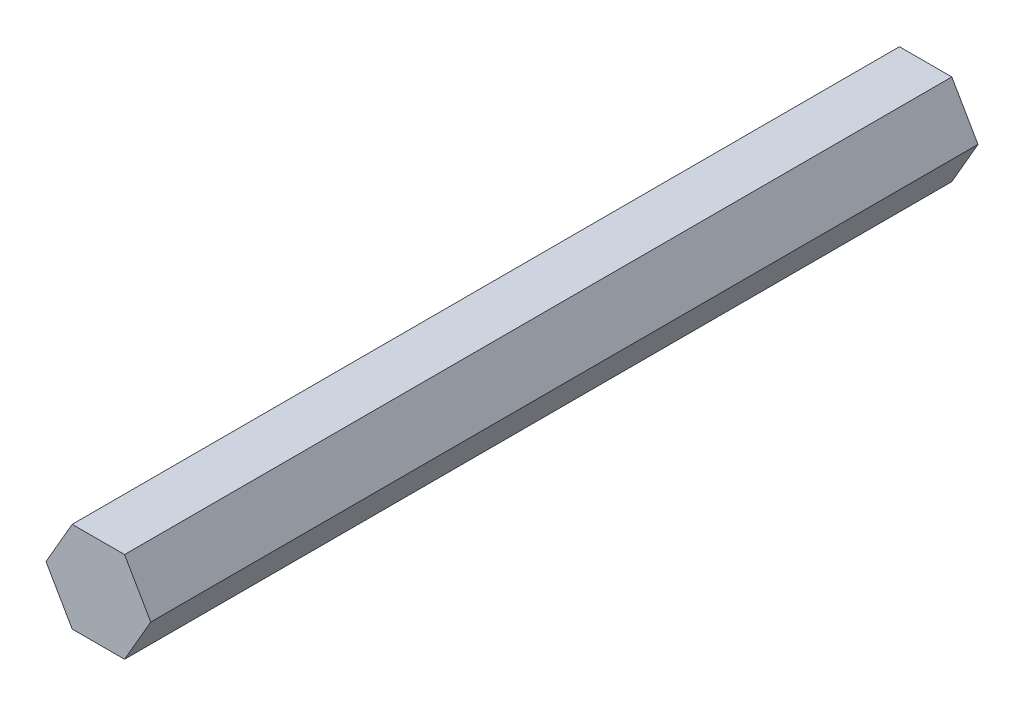
ISO-10303-21;
HEADER;
FILE_DESCRIPTION(('STEP AP214'),'2;1');
FILE_NAME('part.step','',(''),(''),'','','');
FILE_SCHEMA(('AUTOMOTIVE_DESIGN { 1 0 10303 214 1 1 1 1 }'));
ENDSEC;
DATA;
#1=APPLICATION_CONTEXT('core data for automotive mechanical design processes');
#2=APPLICATION_PROTOCOL_DEFINITION('international standard','automotive_design',2000,#1);
#3=PRODUCT_CONTEXT('',#1,'mechanical');
#4=PRODUCT('Part','Part','',(#3));
#5=PRODUCT_RELATED_PRODUCT_CATEGORY('part','',(#4));
#6=PRODUCT_DEFINITION_FORMATION('','',#4);
#7=PRODUCT_DEFINITION_CONTEXT('part definition',#1,'design');
#8=PRODUCT_DEFINITION('design','',#6,#7);
#9=PRODUCT_DEFINITION_SHAPE('','',#8);
#10=(LENGTH_UNIT() NAMED_UNIT(*) SI_UNIT(.MILLI.,.METRE.));
#11=(NAMED_UNIT(*) PLANE_ANGLE_UNIT() SI_UNIT($,.RADIAN.));
#12=(NAMED_UNIT(*) SI_UNIT($,.STERADIAN.) SOLID_ANGLE_UNIT());
#13=UNCERTAINTY_MEASURE_WITH_UNIT(LENGTH_MEASURE(1.E-05),#10,'distance_accuracy_value','');
#14=(GEOMETRIC_REPRESENTATION_CONTEXT(3) GLOBAL_UNCERTAINTY_ASSIGNED_CONTEXT((#13)) GLOBAL_UNIT_ASSIGNED_CONTEXT((#10,
#11,#12)) REPRESENTATION_CONTEXT('',''));
#15=CARTESIAN_POINT('',(0.,0.,0.));
#16=DIRECTION('',(0.,0.,1.));
#17=DIRECTION('',(1.,0.,0.));
#18=AXIS2_PLACEMENT_3D('',#15,#16,#17);
#19=CARTESIAN_POINT('',(-61.7065298609531,-5.99818575147754,115.216279792222));
#20=DIRECTION('',(0.866025403784439,-0.5,0.));
#21=DIRECTION('',(0.,0.,1.));
#22=AXIS2_PLACEMENT_3D('',#19,#20,#21);
#23=PLANE('',#22);
#24=DIRECTION('',(0.5,0.866025403784439,0.));
#25=VECTOR('',#24,1.);
#26=CARTESIAN_POINT('',(-61.7065298609531,-5.99818575147755,-0.607720207778412));
#27=LINE('',#26,#25);
#28=CARTESIAN_POINT('',(-65.3727040703072,-12.3481857514776,-0.607720207778412));
#29=VERTEX_POINT('',#28);
#30=CARTESIAN_POINT('',(-61.7065298609531,-5.99818575147757,-0.607720207778412));
#31=VERTEX_POINT('',#30);
#32=EDGE_CURVE('E87',#29,#31,#27,.T.);
#33=ORIENTED_EDGE('',*,*,#32,.F.);
#34=DIRECTION('',(0.,0.,1.));
#35=VECTOR('',#34,1.);
#36=CARTESIAN_POINT('',(-65.3727040703072,-12.3481857514775,115.216279792222));
#37=LINE('',#36,#35);
#38=CARTESIAN_POINT('',(-65.3727040703072,-12.3481857514775,115.216279792222));
#39=VERTEX_POINT('',#38);
#40=EDGE_CURVE('E41',#39,#29,#37,.F.);
#41=ORIENTED_EDGE('',*,*,#40,.F.);
#42=DIRECTION('',(-0.5,-0.866025403784439,0.));
#43=VECTOR('',#42,1.);
#44=CARTESIAN_POINT('',(-67.2057911749843,-15.5231857514775,115.216279792222));
#45=LINE('',#44,#43);
#46=CARTESIAN_POINT('',(-61.7065298609531,-5.99818575147754,115.216279792222));
#47=VERTEX_POINT('',#46);
#48=EDGE_CURVE('E138',#47,#39,#45,.T.);
#49=ORIENTED_EDGE('',*,*,#48,.F.);
#50=DIRECTION('',(0.,0.,1.));
#51=VECTOR('',#50,1.);
#52=CARTESIAN_POINT('',(-61.7065298609531,-5.99818575147754,115.216279792222));
#53=LINE('',#52,#51);
#54=EDGE_CURVE('E141',#47,#31,#53,.F.);
#55=ORIENTED_EDGE('',*,*,#54,.T.);
#56=EDGE_LOOP('',(#33,#41,#49,#55));
#57=FACE_BOUND('',#56,.T.);
#58=ADVANCED_FACE('F37',(#57),#23,.F.);
#59=CARTESIAN_POINT('',(-61.7065298609531,-18.6981857514775,115.216279792222));
#60=DIRECTION('',(0.,1.,0.));
#61=DIRECTION('',(-1.,0.,0.));
#62=AXIS2_PLACEMENT_3D('',#59,#60,#61);
#63=PLANE('',#62);
#64=DIRECTION('',(-1.,0.,0.));
#65=VECTOR('',#64,1.);
#66=CARTESIAN_POINT('',(-61.7065298609531,-18.6981857514776,-0.607720207778412));
#67=LINE('',#66,#65);
#68=CARTESIAN_POINT('',(-54.3741814422448,-18.6981857514776,-0.607720207778412));
#69=VERTEX_POINT('',#68);
#70=CARTESIAN_POINT('',(-61.706529860953,-18.6981857514776,-0.607720207778407));
#71=VERTEX_POINT('',#70);
#72=EDGE_CURVE('E157',#69,#71,#67,.T.);
#73=ORIENTED_EDGE('',*,*,#72,.F.);
#74=DIRECTION('',(0.,0.,-1.));
#75=VECTOR('',#74,1.);
#76=CARTESIAN_POINT('',(-54.3741814422448,-18.6981857514775,115.216279792222));
#77=LINE('',#76,#75);
#78=CARTESIAN_POINT('',(-54.3741814422448,-18.6981857514775,115.216279792222));
#79=VERTEX_POINT('',#78);
#80=EDGE_CURVE('E154',#69,#79,#77,.F.);
#81=ORIENTED_EDGE('',*,*,#80,.T.);
#82=DIRECTION('',(1.,0.,0.));
#83=VECTOR('',#82,1.);
#84=CARTESIAN_POINT('',(-61.7065298609531,-18.6981857514775,115.216279792222));
#85=LINE('',#84,#83);
#86=CARTESIAN_POINT('',(-61.7065298609531,-18.6981857514775,115.216279792222));
#87=VERTEX_POINT('',#86);
#88=EDGE_CURVE('E149',#87,#79,#85,.T.);
#89=ORIENTED_EDGE('',*,*,#88,.F.);
#90=DIRECTION('',(0.,0.,1.));
#91=VECTOR('',#90,1.);
#92=CARTESIAN_POINT('',(-61.7065298609531,-18.6981857514775,115.216279792222));
#93=LINE('',#92,#91);
#94=EDGE_CURVE('E155',#71,#87,#93,.T.);
#95=ORIENTED_EDGE('',*,*,#94,.F.);
#96=EDGE_LOOP('',(#73,#81,#89,#95));
#97=FACE_BOUND('',#96,.T.);
#98=ADVANCED_FACE('F121',(#97),#63,.F.);
#99=CARTESIAN_POINT('',(-54.3741814422448,-18.6981857514775,115.216279792222));
#100=DIRECTION('',(-0.866025403784439,0.5,0.));
#101=DIRECTION('',(0.,0.,-1.));
#102=AXIS2_PLACEMENT_3D('',#99,#100,#101);
#103=PLANE('',#102);
#104=DIRECTION('',(-0.5,-0.866025403784439,0.));
#105=VECTOR('',#104,1.);
#106=CARTESIAN_POINT('',(-54.3741814422448,-18.6981857514776,-0.607720207778412));
#107=LINE('',#106,#105);
#108=CARTESIAN_POINT('',(-50.7080072328906,-12.3481857514776,-0.607720207778409));
#109=VERTEX_POINT('',#108);
#110=EDGE_CURVE('E81',#109,#69,#107,.T.);
#111=ORIENTED_EDGE('',*,*,#110,.F.);
#112=DIRECTION('',(0.,0.,1.));
#113=VECTOR('',#112,1.);
#114=CARTESIAN_POINT('',(-50.7080072328907,-12.3481857514776,115.216279792222));
#115=LINE('',#114,#113);
#116=CARTESIAN_POINT('',(-50.7080072328907,-12.3481857514776,115.216279792222));
#117=VERTEX_POINT('',#116);
#118=EDGE_CURVE('E104',#109,#117,#115,.T.);
#119=ORIENTED_EDGE('',*,*,#118,.T.);
#120=DIRECTION('',(-0.5,-0.866025403784439,0.));
#121=VECTOR('',#120,1.);
#122=CARTESIAN_POINT('',(-56.2072685469218,-21.8731857514776,115.216279792222));
#123=LINE('',#122,#121);
#124=EDGE_CURVE('E144',#79,#117,#123,.F.);
#125=ORIENTED_EDGE('',*,*,#124,.F.);
#126=ORIENTED_EDGE('',*,*,#80,.F.);
#127=EDGE_LOOP('',(#111,#119,#125,#126));
#128=FACE_BOUND('',#127,.T.);
#129=ADVANCED_FACE('F113',(#128),#103,.F.);
#130=CARTESIAN_POINT('',(-54.3741814422448,-5.99818575147753,115.216279792222));
#131=DIRECTION('',(0.,-1.,0.));
#132=DIRECTION('',(1.,0.,0.));
#133=AXIS2_PLACEMENT_3D('',#130,#131,#132);
#134=PLANE('',#133);
#135=DIRECTION('',(1.,0.,0.));
#136=VECTOR('',#135,1.);
#137=CARTESIAN_POINT('',(-54.3741814422448,-5.99818575147756,-0.607720207778412));
#138=LINE('',#137,#136);
#139=CARTESIAN_POINT('',(-54.3741814422448,-5.99818575147755,-0.607720207778412));
#140=VERTEX_POINT('',#139);
#141=EDGE_CURVE('E105',#31,#140,#138,.T.);
#142=ORIENTED_EDGE('',*,*,#141,.F.);
#143=ORIENTED_EDGE('',*,*,#54,.F.);
#144=DIRECTION('',(1.,0.,0.));
#145=VECTOR('',#144,1.);
#146=CARTESIAN_POINT('',(-54.3741814422448,-5.99818575147753,115.216279792222));
#147=LINE('',#146,#145);
#148=CARTESIAN_POINT('',(-54.3741814422448,-5.99818575147753,115.216279792222));
#149=VERTEX_POINT('',#148);
#150=EDGE_CURVE('E55',#149,#47,#147,.F.);
#151=ORIENTED_EDGE('',*,*,#150,.F.);
#152=DIRECTION('',(0.,0.,1.));
#153=VECTOR('',#152,1.);
#154=CARTESIAN_POINT('',(-54.3741814422448,-5.99818575147753,115.216279792222));
#155=LINE('',#154,#153);
#156=EDGE_CURVE('E11',#149,#140,#155,.F.);
#157=ORIENTED_EDGE('',*,*,#156,.T.);
#158=EDGE_LOOP('',(#142,#143,#151,#157));
#159=FACE_BOUND('',#158,.T.);
#160=ADVANCED_FACE('F111',(#159),#134,.F.);
#161=CARTESIAN_POINT('',(-65.3727040703072,-12.3481857514775,115.216279792222));
#162=DIRECTION('',(0.866025403784438,0.500000000000001,0.));
#163=DIRECTION('',(-0.500000000000001,0.866025403784438,0.));
#164=AXIS2_PLACEMENT_3D('',#161,#162,#163);
#165=PLANE('',#164);
#166=ORIENTED_EDGE('',*,*,#40,.T.);
#167=DIRECTION('',(-0.500000000000001,0.866025403784438,0.));
#168=VECTOR('',#167,1.);
#169=CARTESIAN_POINT('',(-58.9568992039374,-23.4606857514776,-0.607720207778406));
#170=LINE('',#169,#168);
#171=EDGE_CURVE('E106',#71,#29,#170,.T.);
#172=ORIENTED_EDGE('',*,*,#171,.F.);
#173=ORIENTED_EDGE('',*,*,#94,.T.);
#174=DIRECTION('',(0.500000000000001,-0.866025403784438,0.));
#175=VECTOR('',#174,1.);
#176=CARTESIAN_POINT('',(-65.3727040703072,-12.3481857514775,115.216279792222));
#177=LINE('',#176,#175);
#178=EDGE_CURVE('E152',#39,#87,#177,.T.);
#179=ORIENTED_EDGE('',*,*,#178,.F.);
#180=EDGE_LOOP('',(#166,#172,#173,#179));
#181=FACE_BOUND('',#180,.T.);
#182=ADVANCED_FACE('F39',(#181),#165,.F.);
#183=CARTESIAN_POINT('',(-61.7065298609531,-18.6981857514775,115.216279792222));
#184=DIRECTION('',(0.,0.,1.));
#185=DIRECTION('',(-0.5,-0.866025403784439,0.));
#186=AXIS2_PLACEMENT_3D('',#183,#184,#185);
#187=PLANE('',#186);
#188=ORIENTED_EDGE('',*,*,#150,.T.);
#189=ORIENTED_EDGE('',*,*,#48,.T.);
#190=ORIENTED_EDGE('',*,*,#178,.T.);
#191=ORIENTED_EDGE('',*,*,#88,.T.);
#192=ORIENTED_EDGE('',*,*,#124,.T.);
#193=DIRECTION('',(0.500000000000001,-0.866025403784438,0.));
#194=VECTOR('',#193,1.);
#195=CARTESIAN_POINT('',(-50.7080072328907,-12.3481857514776,115.216279792222));
#196=LINE('',#195,#194);
#197=EDGE_CURVE('E47',#117,#149,#196,.F.);
#198=ORIENTED_EDGE('',*,*,#197,.T.);
#199=EDGE_LOOP('',(#188,#189,#190,#191,#192,#198));
#200=FACE_BOUND('',#199,.T.);
#201=ADVANCED_FACE('F119',(#200),#187,.T.);
#202=CARTESIAN_POINT('',(-50.7080072328907,-12.3481857514776,115.216279792222));
#203=DIRECTION('',(-0.866025403784438,-0.500000000000001,0.));
#204=DIRECTION('',(0.500000000000001,-0.866025403784438,0.));
#205=AXIS2_PLACEMENT_3D('',#202,#203,#204);
#206=PLANE('',#205);
#207=ORIENTED_EDGE('',*,*,#118,.F.);
#208=DIRECTION('',(-0.500000000000001,0.866025403784438,0.));
#209=VECTOR('',#208,1.);
#210=CARTESIAN_POINT('',(-47.958376575875,-17.1106857514776,-0.607720207778408));
#211=LINE('',#210,#209);
#212=EDGE_CURVE('E100',#109,#140,#211,.T.);
#213=ORIENTED_EDGE('',*,*,#212,.T.);
#214=ORIENTED_EDGE('',*,*,#156,.F.);
#215=ORIENTED_EDGE('',*,*,#197,.F.);
#216=EDGE_LOOP('',(#207,#213,#214,#215));
#217=FACE_BOUND('',#216,.T.);
#218=ADVANCED_FACE('F101',(#217),#206,.F.);
#219=CARTESIAN_POINT('',(-57.1262019276184,-32.9818280606915,-0.607720207778412));
#220=DIRECTION('',(0.,0.,-1.));
#221=DIRECTION('',(-1.,0.,0.));
#222=AXIS2_PLACEMENT_3D('',#219,#220,#221);
#223=PLANE('',#222);
#224=ORIENTED_EDGE('',*,*,#72,.T.);
#225=ORIENTED_EDGE('',*,*,#171,.T.);
#226=ORIENTED_EDGE('',*,*,#32,.T.);
#227=ORIENTED_EDGE('',*,*,#141,.T.);
#228=ORIENTED_EDGE('',*,*,#212,.F.);
#229=ORIENTED_EDGE('',*,*,#110,.T.);
#230=EDGE_LOOP('',(#224,#225,#226,#227,#228,#229));
#231=FACE_BOUND('',#230,.T.);
#232=ADVANCED_FACE('F108',(#231),#223,.T.);
#233=CLOSED_SHELL('',(#58,#98,#129,#160,#182,#201,#218,#232));
#234=MANIFOLD_SOLID_BREP('B2',#233);
#235=ADVANCED_BREP_SHAPE_REPRESENTATION('',(#18,#234),#14);
#236=SHAPE_DEFINITION_REPRESENTATION(#9,#235);
ENDSEC;
END-ISO-10303-21;
